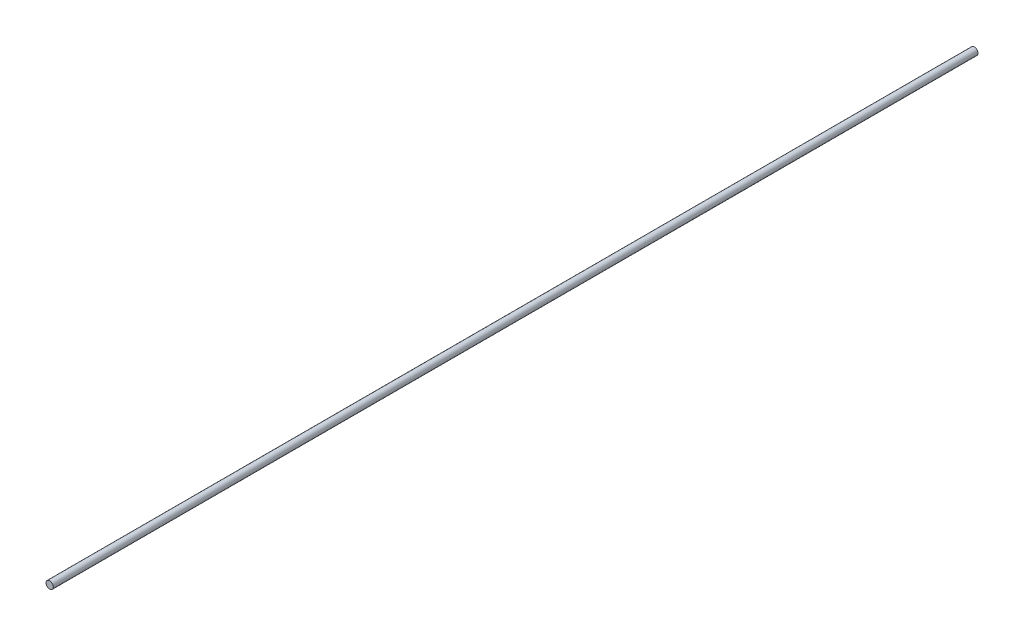
ISO-10303-21;
HEADER;
FILE_DESCRIPTION(('STEP AP214'),'2;1');
FILE_NAME('part.step','',(''),(''),'','','');
FILE_SCHEMA(('AUTOMOTIVE_DESIGN { 1 0 10303 214 1 1 1 1 }'));
ENDSEC;
DATA;
#1=APPLICATION_CONTEXT('core data for automotive mechanical design processes');
#2=APPLICATION_PROTOCOL_DEFINITION('international standard','automotive_design',2000,#1);
#3=PRODUCT_CONTEXT('',#1,'mechanical');
#4=PRODUCT('Part','Part','',(#3));
#5=PRODUCT_RELATED_PRODUCT_CATEGORY('part','',(#4));
#6=PRODUCT_DEFINITION_FORMATION('','',#4);
#7=PRODUCT_DEFINITION_CONTEXT('part definition',#1,'design');
#8=PRODUCT_DEFINITION('design','',#6,#7);
#9=PRODUCT_DEFINITION_SHAPE('','',#8);
#10=(LENGTH_UNIT() NAMED_UNIT(*) SI_UNIT(.MILLI.,.METRE.));
#11=(NAMED_UNIT(*) PLANE_ANGLE_UNIT() SI_UNIT($,.RADIAN.));
#12=(NAMED_UNIT(*) SI_UNIT($,.STERADIAN.) SOLID_ANGLE_UNIT());
#13=UNCERTAINTY_MEASURE_WITH_UNIT(LENGTH_MEASURE(1.E-05),#10,'distance_accuracy_value','');
#14=(GEOMETRIC_REPRESENTATION_CONTEXT(3) GLOBAL_UNCERTAINTY_ASSIGNED_CONTEXT((#13)) GLOBAL_UNIT_ASSIGNED_CONTEXT((#10,
#11,#12)) REPRESENTATION_CONTEXT('',''));
#15=CARTESIAN_POINT('',(0.,0.,0.));
#16=DIRECTION('',(0.,0.,1.));
#17=DIRECTION('',(1.,0.,0.));
#18=AXIS2_PLACEMENT_3D('',#15,#16,#17);
#19=CARTESIAN_POINT('',(0.,0.,-635.));
#20=DIRECTION('',(0.,0.,1.));
#21=DIRECTION('',(1.,0.,0.));
#22=AXIS2_PLACEMENT_3D('',#19,#20,#21);
#23=CYLINDRICAL_SURFACE('',#22,2.5);
#24=CARTESIAN_POINT('',(0.,0.,-635.));
#25=DIRECTION('',(0.,0.,1.));
#26=DIRECTION('',(1.,0.,0.));
#27=AXIS2_PLACEMENT_3D('',#24,#25,#26);
#28=CIRCLE('',#27,2.5);
#29=CARTESIAN_POINT('',(2.5,0.,-635.));
#30=VERTEX_POINT('',#29);
#31=EDGE_CURVE('E10',#30,#30,#28,.T.);
#32=ORIENTED_EDGE('',*,*,#31,.T.);
#33=EDGE_LOOP('',(#32));
#34=FACE_BOUND('',#33,.T.);
#35=CARTESIAN_POINT('',(0.,0.,0.));
#36=DIRECTION('',(0.,0.,1.));
#37=DIRECTION('',(1.,0.,0.));
#38=AXIS2_PLACEMENT_3D('',#35,#36,#37);
#39=CIRCLE('',#38,2.5);
#40=CARTESIAN_POINT('',(2.5,0.,0.));
#41=VERTEX_POINT('',#40);
#42=EDGE_CURVE('E36',#41,#41,#39,.T.);
#43=ORIENTED_EDGE('',*,*,#42,.F.);
#44=EDGE_LOOP('',(#43));
#45=FACE_BOUND('',#44,.T.);
#46=ADVANCED_FACE('F33',(#34,#45),#23,.T.);
#47=CARTESIAN_POINT('',(0.,0.,-635.));
#48=DIRECTION('',(0.,0.,1.));
#49=DIRECTION('',(1.,0.,0.));
#50=AXIS2_PLACEMENT_3D('',#47,#48,#49);
#51=PLANE('',#50);
#52=ORIENTED_EDGE('',*,*,#31,.F.);
#53=EDGE_LOOP('',(#52));
#54=FACE_BOUND('',#53,.T.);
#55=ADVANCED_FACE('F48',(#54),#51,.F.);
#56=CARTESIAN_POINT('',(0.,0.,0.));
#57=DIRECTION('',(0.,0.,1.));
#58=DIRECTION('',(1.,0.,0.));
#59=AXIS2_PLACEMENT_3D('',#56,#57,#58);
#60=PLANE('',#59);
#61=ORIENTED_EDGE('',*,*,#42,.T.);
#62=EDGE_LOOP('',(#61));
#63=FACE_BOUND('',#62,.T.);
#64=ADVANCED_FACE('F45',(#63),#60,.T.);
#65=CLOSED_SHELL('',(#46,#55,#64));
#66=MANIFOLD_SOLID_BREP('B2',#65);
#67=ADVANCED_BREP_SHAPE_REPRESENTATION('',(#18,#66),#14);
#68=SHAPE_DEFINITION_REPRESENTATION(#9,#67);
ENDSEC;
END-ISO-10303-21;
